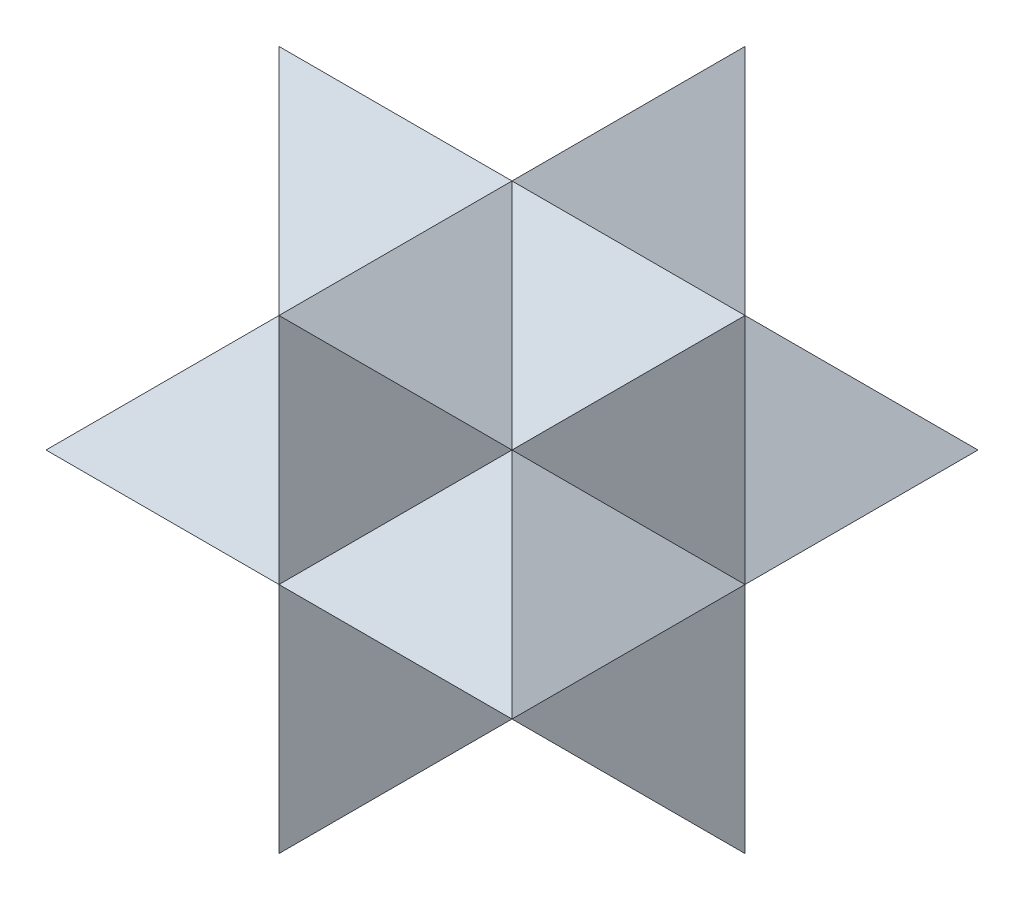
ISO-10303-21;
HEADER;
FILE_DESCRIPTION(('STEP AP214'),'2;1');
FILE_NAME('part.step','',(''),(''),'','','');
FILE_SCHEMA(('AUTOMOTIVE_DESIGN { 1 0 10303 214 1 1 1 1 }'));
ENDSEC;
DATA;
#1=APPLICATION_CONTEXT('core data for automotive mechanical design processes');
#2=APPLICATION_PROTOCOL_DEFINITION('international standard','automotive_design',2000,#1);
#3=PRODUCT_CONTEXT('',#1,'mechanical');
#4=PRODUCT('Part','Part','',(#3));
#5=PRODUCT_RELATED_PRODUCT_CATEGORY('part','',(#4));
#6=PRODUCT_DEFINITION_FORMATION('','',#4);
#7=PRODUCT_DEFINITION_CONTEXT('part definition',#1,'design');
#8=PRODUCT_DEFINITION('design','',#6,#7);
#9=PRODUCT_DEFINITION_SHAPE('','',#8);
#10=(LENGTH_UNIT() NAMED_UNIT(*) SI_UNIT(.MILLI.,.METRE.));
#11=(NAMED_UNIT(*) PLANE_ANGLE_UNIT() SI_UNIT($,.RADIAN.));
#12=(NAMED_UNIT(*) SI_UNIT($,.STERADIAN.) SOLID_ANGLE_UNIT());
#13=UNCERTAINTY_MEASURE_WITH_UNIT(LENGTH_MEASURE(1.E-05),#10,'distance_accuracy_value','');
#14=(GEOMETRIC_REPRESENTATION_CONTEXT(3) GLOBAL_UNCERTAINTY_ASSIGNED_CONTEXT((#13)) GLOBAL_UNIT_ASSIGNED_CONTEXT((#10,
#11,#12)) REPRESENTATION_CONTEXT('',''));
#15=CARTESIAN_POINT('',(0.,0.,0.));
#16=DIRECTION('',(0.,0.,1.));
#17=DIRECTION('',(1.,0.,0.));
#18=AXIS2_PLACEMENT_3D('',#15,#16,#17);
#19=CARTESIAN_POINT('',(0.,-160.009973336649,-160.009973336649));
#20=DIRECTION('',(0.707106781186547,0.,-0.707106781186547));
#21=DIRECTION('',(0.,1.,0.));
#22=AXIS2_PLACEMENT_3D('',#19,#20,#21);
#23=PLANE('',#22);
#24=DIRECTION('',(0.577350269189626,-0.577350269189626,0.577350269189626));
#25=VECTOR('',#24,1.);
#26=CARTESIAN_POINT('',(106.673315557766,53.336657778883,-53.336657778883));
#27=LINE('',#26,#25);
#28=CARTESIAN_POINT('',(80.0049866683244,80.0049866683245,-80.0049866683244));
#29=VERTEX_POINT('',#28);
#30=CARTESIAN_POINT('',(160.009973336649,0.,0.));
#31=VERTEX_POINT('',#30);
#32=EDGE_CURVE('E566',#29,#31,#27,.T.);
#33=ORIENTED_EDGE('',*,*,#32,.F.);
#34=DIRECTION('',(-0.577350269189626,-0.577350269189626,-0.577350269189626));
#35=VECTOR('',#34,1.);
#36=CARTESIAN_POINT('',(80.0049866683244,80.0049866683245,-80.0049866683244));
#37=LINE('',#36,#35);
#38=CARTESIAN_POINT('',(160.009973336649,160.009973336649,0.));
#39=VERTEX_POINT('',#38);
#40=EDGE_CURVE('E594',#39,#29,#37,.T.);
#41=ORIENTED_EDGE('',*,*,#40,.F.);
#42=DIRECTION('',(0.,-1.,0.));
#43=VECTOR('',#42,1.);
#44=CARTESIAN_POINT('',(160.009973336649,0.,0.));
#45=LINE('',#44,#43);
#46=EDGE_CURVE('E597',#39,#31,#45,.T.);
#47=ORIENTED_EDGE('',*,*,#46,.T.);
#48=EDGE_LOOP('',(#33,#41,#47));
#49=FACE_BOUND('',#48,.T.);
#50=ADVANCED_FACE('F360',(#49),#23,.T.);
#51=CARTESIAN_POINT('',(0.,160.009973336649,-160.009973336649));
#52=DIRECTION('',(-0.707106781186548,0.,-0.707106781186547));
#53=DIRECTION('',(0.,-1.,0.));
#54=AXIS2_PLACEMENT_3D('',#51,#52,#53);
#55=PLANE('',#54);
#56=DIRECTION('',(0.577350269189626,-0.577350269189626,-0.577350269189626));
#57=VECTOR('',#56,1.);
#58=CARTESIAN_POINT('',(-53.336657778883,53.336657778883,-106.673315557766));
#59=LINE('',#58,#57);
#60=CARTESIAN_POINT('',(-80.0049866683244,80.0049866683245,-80.0049866683244));
#61=VERTEX_POINT('',#60);
#62=CARTESIAN_POINT('',(0.,0.,-160.009973336649));
#63=VERTEX_POINT('',#62);
#64=EDGE_CURVE('E557',#61,#63,#59,.T.);
#65=ORIENTED_EDGE('',*,*,#64,.F.);
#66=DIRECTION('',(-0.577350269189626,-0.577350269189626,0.577350269189626));
#67=VECTOR('',#66,1.);
#68=CARTESIAN_POINT('',(-80.0049866683244,80.0049866683245,-80.0049866683244));
#69=LINE('',#68,#67);
#70=CARTESIAN_POINT('',(0.,160.009973336649,-160.009973336649));
#71=VERTEX_POINT('',#70);
#72=EDGE_CURVE('E610',#71,#61,#69,.T.);
#73=ORIENTED_EDGE('',*,*,#72,.F.);
#74=DIRECTION('',(0.,1.,0.));
#75=VECTOR('',#74,1.);
#76=CARTESIAN_POINT('',(0.,0.,-160.009973336649));
#77=LINE('',#76,#75);
#78=EDGE_CURVE('E640',#63,#71,#77,.T.);
#79=ORIENTED_EDGE('',*,*,#78,.F.);
#80=EDGE_LOOP('',(#65,#73,#79));
#81=FACE_BOUND('',#80,.T.);
#82=ADVANCED_FACE('F701',(#81),#55,.T.);
#83=CARTESIAN_POINT('',(0.,-160.009973336649,160.009973336649));
#84=DIRECTION('',(-0.707106781186547,0.,0.707106781186548));
#85=DIRECTION('',(0.,1.,0.));
#86=AXIS2_PLACEMENT_3D('',#83,#84,#85);
#87=PLANE('',#86);
#88=DIRECTION('',(-0.577350269189626,0.577350269189626,-0.577350269189626));
#89=VECTOR('',#88,1.);
#90=CARTESIAN_POINT('',(53.336657778883,-53.336657778883,213.346631115532));
#91=LINE('',#90,#89);
#92=CARTESIAN_POINT('',(0.,0.,160.009973336649));
#93=VERTEX_POINT('',#92);
#94=CARTESIAN_POINT('',(-80.0049866683244,80.0049866683244,80.0049866683244));
#95=VERTEX_POINT('',#94);
#96=EDGE_CURVE('E571',#93,#95,#91,.T.);
#97=ORIENTED_EDGE('',*,*,#96,.F.);
#98=DIRECTION('',(0.,-1.,0.));
#99=VECTOR('',#98,1.);
#100=CARTESIAN_POINT('',(0.,0.,160.009973336649));
#101=LINE('',#100,#99);
#102=CARTESIAN_POINT('',(0.,160.009973336649,160.009973336649));
#103=VERTEX_POINT('',#102);
#104=EDGE_CURVE('E631',#103,#93,#101,.T.);
#105=ORIENTED_EDGE('',*,*,#104,.F.);
#106=DIRECTION('',(-0.577350269189626,-0.577350269189626,-0.577350269189626));
#107=VECTOR('',#106,1.);
#108=CARTESIAN_POINT('',(-80.0049866683244,80.0049866683244,80.0049866683244));
#109=LINE('',#108,#107);
#110=EDGE_CURVE('E618',#103,#95,#109,.T.);
#111=ORIENTED_EDGE('',*,*,#110,.T.);
#112=EDGE_LOOP('',(#97,#105,#111));
#113=FACE_BOUND('',#112,.T.);
#114=ADVANCED_FACE('F694',(#113),#87,.T.);
#115=CARTESIAN_POINT('',(0.,160.009973336649,160.009973336649));
#116=DIRECTION('',(0.707106781186547,0.,0.707106781186547));
#117=DIRECTION('',(0.,-1.,0.));
#118=AXIS2_PLACEMENT_3D('',#115,#116,#117);
#119=PLANE('',#118);
#120=DIRECTION('',(-0.577350269189626,-0.577350269189626,0.577350269189626));
#121=VECTOR('',#120,1.);
#122=CARTESIAN_POINT('',(53.336657778883,53.336657778883,106.673315557766));
#123=LINE('',#122,#121);
#124=CARTESIAN_POINT('',(80.0049866683245,80.0049866683244,80.0049866683245));
#125=VERTEX_POINT('',#124);
#126=EDGE_CURVE('E569',#125,#93,#123,.T.);
#127=ORIENTED_EDGE('',*,*,#126,.F.);
#128=DIRECTION('',(0.577350269189626,-0.577350269189626,-0.577350269189626));
#129=VECTOR('',#128,1.);
#130=CARTESIAN_POINT('',(80.0049866683244,80.0049866683244,80.0049866683245));
#131=LINE('',#130,#129);
#132=EDGE_CURVE('E628',#103,#125,#131,.T.);
#133=ORIENTED_EDGE('',*,*,#132,.F.);
#134=ORIENTED_EDGE('',*,*,#104,.T.);
#135=EDGE_LOOP('',(#127,#133,#134));
#136=FACE_BOUND('',#135,.T.);
#137=ADVANCED_FACE('F732',(#136),#119,.T.);
#138=CARTESIAN_POINT('',(0.,160.009973336649,-160.009973336649));
#139=DIRECTION('',(0.707106781186547,0.707106781186547,0.));
#140=DIRECTION('',(0.,0.,1.));
#141=AXIS2_PLACEMENT_3D('',#138,#139,#140);
#142=PLANE('',#141);
#143=DIRECTION('',(-0.577350269189626,0.577350269189626,0.577350269189626));
#144=VECTOR('',#143,1.);
#145=CARTESIAN_POINT('',(53.336657778883,106.673315557766,-53.336657778883));
#146=LINE('',#145,#144);
#147=CARTESIAN_POINT('',(0.,160.009973336649,0.));
#148=VERTEX_POINT('',#147);
#149=EDGE_CURVE('E586',#29,#148,#146,.T.);
#150=ORIENTED_EDGE('',*,*,#149,.F.);
#151=DIRECTION('',(0.577350269189626,-0.577350269189626,0.577350269189626));
#152=VECTOR('',#151,1.);
#153=CARTESIAN_POINT('',(80.0049866683244,80.0049866683245,-80.0049866683244));
#154=LINE('',#153,#152);
#155=EDGE_CURVE('E614',#71,#29,#154,.T.);
#156=ORIENTED_EDGE('',*,*,#155,.F.);
#157=DIRECTION('',(0.,0.,1.));
#158=VECTOR('',#157,1.);
#159=CARTESIAN_POINT('',(0.,160.009973336649,0.));
#160=LINE('',#159,#158);
#161=EDGE_CURVE('E623',#71,#148,#160,.T.);
#162=ORIENTED_EDGE('',*,*,#161,.T.);
#163=EDGE_LOOP('',(#150,#156,#162));
#164=FACE_BOUND('',#163,.T.);
#165=ADVANCED_FACE('F724',(#164),#142,.T.);
#166=DIRECTION('',(0.577350269189626,0.577350269189626,0.577350269189626));
#167=VECTOR('',#166,1.);
#168=CARTESIAN_POINT('',(-53.3366577788829,-53.336657778883,-213.346631115532));
#169=LINE('',#168,#167);
#170=EDGE_CURVE('E560',#63,#29,#169,.T.);
#171=ORIENTED_EDGE('',*,*,#170,.F.);
#172=ORIENTED_EDGE('',*,*,#78,.T.);
#173=ORIENTED_EDGE('',*,*,#155,.T.);
#174=EDGE_LOOP('',(#171,#172,#173));
#175=FACE_BOUND('',#174,.T.);
#176=ADVANCED_FACE('F362',(#175),#23,.T.);
#177=DIRECTION('',(0.577350269189626,0.577350269189626,-0.577350269189626));
#178=VECTOR('',#177,1.);
#179=CARTESIAN_POINT('',(0.,160.009973336649,-160.009973336649));
#180=LINE('',#179,#178);
#181=CARTESIAN_POINT('',(-160.009973336649,0.,0.));
#182=VERTEX_POINT('',#181);
#183=EDGE_CURVE('E554',#182,#61,#180,.T.);
#184=ORIENTED_EDGE('',*,*,#183,.F.);
#185=DIRECTION('',(0.,1.,0.));
#186=VECTOR('',#185,1.);
#187=CARTESIAN_POINT('',(-160.009973336649,0.,0.));
#188=LINE('',#187,#186);
#189=CARTESIAN_POINT('',(-160.009973336649,160.009973336649,0.));
#190=VERTEX_POINT('',#189);
#191=EDGE_CURVE('E587',#182,#190,#188,.T.);
#192=ORIENTED_EDGE('',*,*,#191,.T.);
#193=DIRECTION('',(0.577350269189626,-0.577350269189626,-0.577350269189626));
#194=VECTOR('',#193,1.);
#195=CARTESIAN_POINT('',(-80.0049866683244,80.0049866683245,-80.0049866683244));
#196=LINE('',#195,#194);
#197=EDGE_CURVE('E588',#190,#61,#196,.T.);
#198=ORIENTED_EDGE('',*,*,#197,.T.);
#199=EDGE_LOOP('',(#184,#192,#198));
#200=FACE_BOUND('',#199,.T.);
#201=ADVANCED_FACE('F721',(#200),#55,.T.);
#202=CARTESIAN_POINT('',(0.,160.009973336649,160.009973336649));
#203=DIRECTION('',(-0.707106781186548,0.707106781186547,0.));
#204=DIRECTION('',(0.,0.,-1.));
#205=AXIS2_PLACEMENT_3D('',#202,#203,#204);
#206=PLANE('',#205);
#207=DIRECTION('',(-0.577350269189626,-0.577350269189626,-0.577350269189626));
#208=VECTOR('',#207,1.);
#209=CARTESIAN_POINT('',(53.336657778883,213.346631115532,53.336657778883));
#210=LINE('',#209,#208);
#211=EDGE_CURVE('E626',#148,#61,#210,.T.);
#212=ORIENTED_EDGE('',*,*,#211,.F.);
#213=ORIENTED_EDGE('',*,*,#161,.F.);
#214=ORIENTED_EDGE('',*,*,#72,.T.);
#215=EDGE_LOOP('',(#212,#213,#214));
#216=FACE_BOUND('',#215,.T.);
#217=ADVANCED_FACE('F730',(#216),#206,.T.);
#218=CARTESIAN_POINT('',(-160.009973336649,160.009973336649,0.));
#219=DIRECTION('',(0.,0.707106781186548,-0.707106781186547));
#220=DIRECTION('',(1.,0.,0.));
#221=AXIS2_PLACEMENT_3D('',#218,#219,#220);
#222=PLANE('',#221);
#223=DIRECTION('',(1.,0.,0.));
#224=VECTOR('',#223,1.);
#225=CARTESIAN_POINT('',(0.,160.009973336649,0.));
#226=LINE('',#225,#224);
#227=EDGE_CURVE('E590',#190,#148,#226,.T.);
#228=ORIENTED_EDGE('',*,*,#227,.T.);
#229=ORIENTED_EDGE('',*,*,#211,.T.);
#230=ORIENTED_EDGE('',*,*,#197,.F.);
#231=EDGE_LOOP('',(#228,#229,#230));
#232=FACE_BOUND('',#231,.T.);
#233=ADVANCED_FACE('F762',(#232),#222,.T.);
#234=ORIENTED_EDGE('',*,*,#40,.T.);
#235=ORIENTED_EDGE('',*,*,#149,.T.);
#236=EDGE_CURVE('E593',#148,#39,#226,.T.);
#237=ORIENTED_EDGE('',*,*,#236,.T.);
#238=EDGE_LOOP('',(#234,#235,#237));
#239=FACE_BOUND('',#238,.T.);
#240=ADVANCED_FACE('F768',(#239),#222,.T.);
#241=CARTESIAN_POINT('',(160.009973336649,160.009973336649,0.));
#242=DIRECTION('',(0.,0.707106781186547,0.707106781186547));
#243=DIRECTION('',(-1.,0.,0.));
#244=AXIS2_PLACEMENT_3D('',#241,#242,#243);
#245=PLANE('',#244);
#246=ORIENTED_EDGE('',*,*,#236,.F.);
#247=DIRECTION('',(0.577350269189626,-0.577350269189626,0.577350269189626));
#248=VECTOR('',#247,1.);
#249=CARTESIAN_POINT('',(-53.336657778883,213.346631115532,-53.336657778883));
#250=LINE('',#249,#248);
#251=EDGE_CURVE('E647',#148,#125,#250,.T.);
#252=ORIENTED_EDGE('',*,*,#251,.T.);
#253=DIRECTION('',(-0.577350269189626,-0.577350269189626,0.577350269189626));
#254=VECTOR('',#253,1.);
#255=CARTESIAN_POINT('',(80.0049866683244,80.0049866683244,80.0049866683244));
#256=LINE('',#255,#254);
#257=EDGE_CURVE('E490',#39,#125,#256,.T.);
#258=ORIENTED_EDGE('',*,*,#257,.F.);
#259=EDGE_LOOP('',(#246,#252,#258));
#260=FACE_BOUND('',#259,.T.);
#261=ADVANCED_FACE('F812',(#260),#245,.T.);
#262=DIRECTION('',(-0.577350269189626,-0.577350269189626,-0.577350269189626));
#263=VECTOR('',#262,1.);
#264=CARTESIAN_POINT('',(-106.673315557766,53.3366577788829,53.336657778883));
#265=LINE('',#264,#263);
#266=EDGE_CURVE('E530',#95,#182,#265,.T.);
#267=ORIENTED_EDGE('',*,*,#266,.F.);
#268=DIRECTION('',(0.577350269189626,-0.577350269189626,0.577350269189626));
#269=VECTOR('',#268,1.);
#270=CARTESIAN_POINT('',(-80.0049866683244,80.0049866683244,80.0049866683244));
#271=LINE('',#270,#269);
#272=EDGE_CURVE('E576',#190,#95,#271,.T.);
#273=ORIENTED_EDGE('',*,*,#272,.F.);
#274=ORIENTED_EDGE('',*,*,#191,.F.);
#275=EDGE_LOOP('',(#267,#273,#274));
#276=FACE_BOUND('',#275,.T.);
#277=ADVANCED_FACE('F693',(#276),#87,.T.);
#278=DIRECTION('',(-0.577350269189626,0.577350269189626,0.577350269189626));
#279=VECTOR('',#278,1.);
#280=CARTESIAN_POINT('',(0.,160.009973336649,160.009973336649));
#281=LINE('',#280,#279);
#282=EDGE_CURVE('E563',#31,#125,#281,.T.);
#283=ORIENTED_EDGE('',*,*,#282,.F.);
#284=ORIENTED_EDGE('',*,*,#46,.F.);
#285=ORIENTED_EDGE('',*,*,#257,.T.);
#286=EDGE_LOOP('',(#283,#284,#285));
#287=FACE_BOUND('',#286,.T.);
#288=ADVANCED_FACE('F811',(#287),#119,.T.);
#289=ORIENTED_EDGE('',*,*,#251,.F.);
#290=EDGE_CURVE('E627',#148,#103,#160,.T.);
#291=ORIENTED_EDGE('',*,*,#290,.T.);
#292=ORIENTED_EDGE('',*,*,#132,.T.);
#293=EDGE_LOOP('',(#289,#291,#292));
#294=FACE_BOUND('',#293,.T.);
#295=ADVANCED_FACE('F735',(#294),#142,.T.);
#296=DIRECTION('',(0.577350269189626,0.577350269189626,-0.577350269189626));
#297=VECTOR('',#296,1.);
#298=CARTESIAN_POINT('',(-53.336657778883,106.673315557766,53.336657778883));
#299=LINE('',#298,#297);
#300=EDGE_CURVE('E479',#95,#148,#299,.T.);
#301=ORIENTED_EDGE('',*,*,#300,.F.);
#302=ORIENTED_EDGE('',*,*,#110,.F.);
#303=ORIENTED_EDGE('',*,*,#290,.F.);
#304=EDGE_LOOP('',(#301,#302,#303));
#305=FACE_BOUND('',#304,.T.);
#306=ADVANCED_FACE('F829',(#305),#206,.T.);
#307=ORIENTED_EDGE('',*,*,#272,.T.);
#308=ORIENTED_EDGE('',*,*,#300,.T.);
#309=ORIENTED_EDGE('',*,*,#227,.F.);
#310=EDGE_LOOP('',(#307,#308,#309));
#311=FACE_BOUND('',#310,.T.);
#312=ADVANCED_FACE('F822',(#311),#245,.T.);
#313=CARTESIAN_POINT('',(160.009973336649,0.,160.009973336649));
#314=DIRECTION('',(0.707106781186548,0.707106781186547,0.));
#315=DIRECTION('',(0.,0.,-1.));
#316=AXIS2_PLACEMENT_3D('',#313,#314,#315);
#317=PLANE('',#316);
#318=DIRECTION('',(0.,0.,-1.));
#319=VECTOR('',#318,1.);
#320=CARTESIAN_POINT('',(160.009973336649,0.,0.));
#321=LINE('',#320,#319);
#322=CARTESIAN_POINT('',(160.009973336649,0.,160.009973336649));
#323=VERTEX_POINT('',#322);
#324=EDGE_CURVE('E513',#323,#31,#321,.T.);
#325=ORIENTED_EDGE('',*,*,#324,.T.);
#326=ORIENTED_EDGE('',*,*,#282,.T.);
#327=DIRECTION('',(-0.577350269189626,0.577350269189626,-0.577350269189626));
#328=VECTOR('',#327,1.);
#329=CARTESIAN_POINT('',(80.0049866683244,80.0049866683245,80.0049866683245));
#330=LINE('',#329,#328);
#331=EDGE_CURVE('E531',#323,#125,#330,.T.);
#332=ORIENTED_EDGE('',*,*,#331,.F.);
#333=EDGE_LOOP('',(#325,#326,#332));
#334=FACE_BOUND('',#333,.T.);
#335=ADVANCED_FACE('F839',(#334),#317,.T.);
#336=CARTESIAN_POINT('',(-160.009973336649,0.,160.009973336649));
#337=DIRECTION('',(0.,0.707106781186547,0.707106781186548));
#338=DIRECTION('',(1.,0.,0.));
#339=AXIS2_PLACEMENT_3D('',#336,#337,#338);
#340=PLANE('',#339);
#341=ORIENTED_EDGE('',*,*,#331,.T.);
#342=ORIENTED_EDGE('',*,*,#126,.T.);
#343=DIRECTION('',(1.,0.,0.));
#344=VECTOR('',#343,1.);
#345=CARTESIAN_POINT('',(0.,0.,160.009973336649));
#346=LINE('',#345,#344);
#347=EDGE_CURVE('E508',#93,#323,#346,.T.);
#348=ORIENTED_EDGE('',*,*,#347,.T.);
#349=EDGE_LOOP('',(#341,#342,#348));
#350=FACE_BOUND('',#349,.T.);
#351=ADVANCED_FACE('F841',(#350),#340,.T.);
#352=CARTESIAN_POINT('',(-160.009973336649,0.,-160.009973336649));
#353=DIRECTION('',(-0.707106781186548,0.707106781186547,0.));
#354=DIRECTION('',(0.,0.,1.));
#355=AXIS2_PLACEMENT_3D('',#352,#353,#354);
#356=PLANE('',#355);
#357=DIRECTION('',(0.577350269189626,0.577350269189626,-0.577350269189626));
#358=VECTOR('',#357,1.);
#359=CARTESIAN_POINT('',(-80.0049866683244,80.0049866683245,80.0049866683245));
#360=LINE('',#359,#358);
#361=CARTESIAN_POINT('',(-160.009973336649,0.,160.009973336649));
#362=VERTEX_POINT('',#361);
#363=EDGE_CURVE('E509',#362,#95,#360,.T.);
#364=ORIENTED_EDGE('',*,*,#363,.T.);
#365=ORIENTED_EDGE('',*,*,#266,.T.);
#366=DIRECTION('',(0.,0.,1.));
#367=VECTOR('',#366,1.);
#368=CARTESIAN_POINT('',(-160.009973336649,0.,0.));
#369=LINE('',#368,#367);
#370=EDGE_CURVE('E549',#182,#362,#369,.T.);
#371=ORIENTED_EDGE('',*,*,#370,.T.);
#372=EDGE_LOOP('',(#364,#365,#371));
#373=FACE_BOUND('',#372,.T.);
#374=ADVANCED_FACE('F667',(#373),#356,.T.);
#375=EDGE_CURVE('E527',#362,#93,#346,.T.);
#376=ORIENTED_EDGE('',*,*,#375,.T.);
#377=ORIENTED_EDGE('',*,*,#96,.T.);
#378=ORIENTED_EDGE('',*,*,#363,.F.);
#379=EDGE_LOOP('',(#376,#377,#378));
#380=FACE_BOUND('',#379,.T.);
#381=ADVANCED_FACE('F671',(#380),#340,.T.);
#382=CARTESIAN_POINT('',(-160.009973336649,0.,-160.009973336649));
#383=VERTEX_POINT('',#382);
#384=EDGE_CURVE('E546',#383,#182,#369,.T.);
#385=ORIENTED_EDGE('',*,*,#384,.T.);
#386=ORIENTED_EDGE('',*,*,#183,.T.);
#387=DIRECTION('',(0.577350269189626,0.577350269189626,0.577350269189626));
#388=VECTOR('',#387,1.);
#389=CARTESIAN_POINT('',(-80.0049866683244,80.0049866683245,-80.0049866683244));
#390=LINE('',#389,#388);
#391=EDGE_CURVE('E543',#383,#61,#390,.T.);
#392=ORIENTED_EDGE('',*,*,#391,.F.);
#393=EDGE_LOOP('',(#385,#386,#392));
#394=FACE_BOUND('',#393,.T.);
#395=ADVANCED_FACE('F756',(#394),#356,.T.);
#396=CARTESIAN_POINT('',(160.009973336649,0.,-160.009973336649));
#397=DIRECTION('',(0.,0.707106781186547,-0.707106781186547));
#398=DIRECTION('',(-1.,0.,0.));
#399=AXIS2_PLACEMENT_3D('',#396,#397,#398);
#400=PLANE('',#399);
#401=ORIENTED_EDGE('',*,*,#391,.T.);
#402=ORIENTED_EDGE('',*,*,#64,.T.);
#403=DIRECTION('',(-1.,0.,0.));
#404=VECTOR('',#403,1.);
#405=CARTESIAN_POINT('',(0.,0.,-160.009973336649));
#406=LINE('',#405,#404);
#407=EDGE_CURVE('E542',#63,#383,#406,.T.);
#408=ORIENTED_EDGE('',*,*,#407,.T.);
#409=EDGE_LOOP('',(#401,#402,#408));
#410=FACE_BOUND('',#409,.T.);
#411=ADVANCED_FACE('F753',(#410),#400,.T.);
#412=DIRECTION('',(-0.577350269189626,0.577350269189626,0.577350269189626));
#413=VECTOR('',#412,1.);
#414=CARTESIAN_POINT('',(80.0049866683244,80.0049866683245,-80.0049866683244));
#415=LINE('',#414,#413);
#416=CARTESIAN_POINT('',(160.009973336649,0.,-160.009973336649));
#417=VERTEX_POINT('',#416);
#418=EDGE_CURVE('E536',#417,#29,#415,.T.);
#419=ORIENTED_EDGE('',*,*,#418,.T.);
#420=ORIENTED_EDGE('',*,*,#32,.T.);
#421=EDGE_CURVE('E535',#31,#417,#321,.T.);
#422=ORIENTED_EDGE('',*,*,#421,.T.);
#423=EDGE_LOOP('',(#419,#420,#422));
#424=FACE_BOUND('',#423,.T.);
#425=ADVANCED_FACE('F773',(#424),#317,.T.);
#426=EDGE_CURVE('E539',#417,#63,#406,.T.);
#427=ORIENTED_EDGE('',*,*,#426,.T.);
#428=ORIENTED_EDGE('',*,*,#170,.T.);
#429=ORIENTED_EDGE('',*,*,#418,.F.);
#430=EDGE_LOOP('',(#427,#428,#429));
#431=FACE_BOUND('',#430,.T.);
#432=ADVANCED_FACE('F744',(#431),#400,.T.);
#433=CARTESIAN_POINT('',(160.009973336649,0.,-160.009973336649));
#434=DIRECTION('',(0.707106781186547,-0.707106781186548,0.));
#435=DIRECTION('',(0.,0.,1.));
#436=AXIS2_PLACEMENT_3D('',#433,#434,#435);
#437=PLANE('',#436);
#438=ORIENTED_EDGE('',*,*,#421,.F.);
#439=DIRECTION('',(-0.577350269189626,-0.577350269189625,-0.577350269189626));
#440=VECTOR('',#439,1.);
#441=CARTESIAN_POINT('',(0.,-160.009973336649,-160.009973336649));
#442=LINE('',#441,#440);
#443=CARTESIAN_POINT('',(80.0049866683244,-80.0049866683244,-80.0049866683245));
#444=VERTEX_POINT('',#443);
#445=EDGE_CURVE('E650',#31,#444,#442,.T.);
#446=ORIENTED_EDGE('',*,*,#445,.T.);
#447=DIRECTION('',(-0.577350269189626,-0.577350269189626,0.577350269189626));
#448=VECTOR('',#447,1.);
#449=CARTESIAN_POINT('',(80.0049866683244,-80.0049866683244,-80.0049866683245));
#450=LINE('',#449,#448);
#451=EDGE_CURVE('E514',#417,#444,#450,.T.);
#452=ORIENTED_EDGE('',*,*,#451,.F.);
#453=EDGE_LOOP('',(#438,#446,#452));
#454=FACE_BOUND('',#453,.T.);
#455=ADVANCED_FACE('F775',(#454),#437,.T.);
#456=CARTESIAN_POINT('',(-160.009973336649,0.,-160.009973336649));
#457=DIRECTION('',(0.,-0.707106781186547,-0.707106781186547));
#458=DIRECTION('',(1.,0.,0.));
#459=AXIS2_PLACEMENT_3D('',#456,#457,#458);
#460=PLANE('',#459);
#461=ORIENTED_EDGE('',*,*,#451,.T.);
#462=DIRECTION('',(-0.577350269189626,0.577350269189626,-0.577350269189626));
#463=VECTOR('',#462,1.);
#464=CARTESIAN_POINT('',(53.336657778883,-53.3366577788829,-106.673315557766));
#465=LINE('',#464,#463);
#466=EDGE_CURVE('E653',#444,#63,#465,.T.);
#467=ORIENTED_EDGE('',*,*,#466,.T.);
#468=ORIENTED_EDGE('',*,*,#426,.F.);
#469=EDGE_LOOP('',(#461,#467,#468));
#470=FACE_BOUND('',#469,.T.);
#471=ADVANCED_FACE('F748',(#470),#460,.T.);
#472=CARTESIAN_POINT('',(-160.009973336649,-160.009973336649,0.));
#473=DIRECTION('',(0.,-0.707106781186547,0.707106781186547));
#474=DIRECTION('',(1.,0.,0.));
#475=AXIS2_PLACEMENT_3D('',#472,#473,#474);
#476=PLANE('',#475);
#477=DIRECTION('',(-0.577350269189626,0.577350269189626,0.577350269189626));
#478=VECTOR('',#477,1.);
#479=CARTESIAN_POINT('',(80.0049866683244,-80.0049866683244,80.0049866683244));
#480=LINE('',#479,#478);
#481=CARTESIAN_POINT('',(160.009973336649,-160.009973336649,0.));
#482=VERTEX_POINT('',#481);
#483=CARTESIAN_POINT('',(80.0049866683244,-80.0049866683244,80.0049866683244));
#484=VERTEX_POINT('',#483);
#485=EDGE_CURVE('E482',#482,#484,#480,.T.);
#486=ORIENTED_EDGE('',*,*,#485,.T.);
#487=DIRECTION('',(-0.577350269189626,-0.577350269189626,-0.577350269189626));
#488=VECTOR('',#487,1.);
#489=CARTESIAN_POINT('',(53.3366577788829,-106.673315557766,53.336657778883));
#490=LINE('',#489,#488);
#491=CARTESIAN_POINT('',(0.,-160.009973336649,0.));
#492=VERTEX_POINT('',#491);
#493=EDGE_CURVE('E471',#484,#492,#490,.T.);
#494=ORIENTED_EDGE('',*,*,#493,.T.);
#495=DIRECTION('',(-1.,0.,0.));
#496=VECTOR('',#495,1.);
#497=CARTESIAN_POINT('',(0.,-160.009973336649,0.));
#498=LINE('',#497,#496);
#499=EDGE_CURVE('E486',#482,#492,#498,.T.);
#500=ORIENTED_EDGE('',*,*,#499,.F.);
#501=EDGE_LOOP('',(#486,#494,#500));
#502=FACE_BOUND('',#501,.T.);
#503=ADVANCED_FACE('F484',(#502),#476,.T.);
#504=CARTESIAN_POINT('',(0.,-160.009973336649,160.009973336649));
#505=DIRECTION('',(0.707106781186547,-0.707106781186547,0.));
#506=DIRECTION('',(0.,0.,-1.));
#507=AXIS2_PLACEMENT_3D('',#504,#505,#506);
#508=PLANE('',#507);
#509=ORIENTED_EDGE('',*,*,#493,.F.);
#510=DIRECTION('',(0.577350269189626,0.577350269189626,-0.577350269189626));
#511=VECTOR('',#510,1.);
#512=CARTESIAN_POINT('',(80.0049866683244,-80.0049866683244,80.0049866683244));
#513=LINE('',#512,#511);
#514=CARTESIAN_POINT('',(0.,-160.009973336649,160.009973336649));
#515=VERTEX_POINT('',#514);
#516=EDGE_CURVE('E459',#515,#484,#513,.T.);
#517=ORIENTED_EDGE('',*,*,#516,.F.);
#518=DIRECTION('',(0.,0.,-1.));
#519=VECTOR('',#518,1.);
#520=CARTESIAN_POINT('',(0.,-160.009973336649,0.));
#521=LINE('',#520,#519);
#522=EDGE_CURVE('E468',#515,#492,#521,.T.);
#523=ORIENTED_EDGE('',*,*,#522,.T.);
#524=EDGE_LOOP('',(#509,#517,#523));
#525=FACE_BOUND('',#524,.T.);
#526=ADVANCED_FACE('F473',(#525),#508,.T.);
#527=CARTESIAN_POINT('',(0.,-160.009973336649,-160.009973336649));
#528=DIRECTION('',(-0.707106781186547,-0.707106781186548,0.));
#529=DIRECTION('',(0.,0.,1.));
#530=AXIS2_PLACEMENT_3D('',#527,#528,#529);
#531=PLANE('',#530);
#532=DIRECTION('',(-0.577350269189626,0.577350269189626,0.577350269189626));
#533=VECTOR('',#532,1.);
#534=CARTESIAN_POINT('',(53.336657778883,-213.346631115532,-53.336657778883));
#535=LINE('',#534,#533);
#536=CARTESIAN_POINT('',(-80.0049866683244,-80.0049866683244,80.0049866683244));
#537=VERTEX_POINT('',#536);
#538=EDGE_CURVE('E478',#492,#537,#535,.T.);
#539=ORIENTED_EDGE('',*,*,#538,.F.);
#540=ORIENTED_EDGE('',*,*,#522,.F.);
#541=DIRECTION('',(-0.577350269189626,0.577350269189626,-0.577350269189626));
#542=VECTOR('',#541,1.);
#543=CARTESIAN_POINT('',(-80.0049866683244,-80.0049866683244,80.0049866683244));
#544=LINE('',#543,#542);
#545=EDGE_CURVE('E615',#515,#537,#544,.T.);
#546=ORIENTED_EDGE('',*,*,#545,.T.);
#547=EDGE_LOOP('',(#539,#540,#546));
#548=FACE_BOUND('',#547,.T.);
#549=ADVANCED_FACE('F684',(#548),#531,.T.);
#550=DIRECTION('',(0.577350269189626,0.577350269189626,0.577350269189626));
#551=VECTOR('',#550,1.);
#552=CARTESIAN_POINT('',(-53.336657778883,-53.3366577788829,106.673315557766));
#553=LINE('',#552,#551);
#554=EDGE_CURVE('E12',#537,#93,#553,.T.);
#555=ORIENTED_EDGE('',*,*,#554,.F.);
#556=ORIENTED_EDGE('',*,*,#545,.F.);
#557=EDGE_CURVE('E465',#93,#515,#101,.T.);
#558=ORIENTED_EDGE('',*,*,#557,.F.);
#559=EDGE_LOOP('',(#555,#556,#558));
#560=FACE_BOUND('',#559,.T.);
#561=ADVANCED_FACE('F677',(#560),#87,.T.);
#562=DIRECTION('',(0.577350269189626,-0.577350269189626,-0.577350269189626));
#563=VECTOR('',#562,1.);
#564=CARTESIAN_POINT('',(-53.336657778883,53.3366577788829,213.346631115532));
#565=LINE('',#564,#563);
#566=EDGE_CURVE('E463',#93,#484,#565,.T.);
#567=ORIENTED_EDGE('',*,*,#566,.F.);
#568=ORIENTED_EDGE('',*,*,#557,.T.);
#569=ORIENTED_EDGE('',*,*,#516,.T.);
#570=EDGE_LOOP('',(#567,#568,#569));
#571=FACE_BOUND('',#570,.T.);
#572=ADVANCED_FACE('F461',(#571),#119,.T.);
#573=CARTESIAN_POINT('',(-160.009973336649,-160.009973336649,0.));
#574=VERTEX_POINT('',#573);
#575=EDGE_CURVE('E603',#492,#574,#498,.T.);
#576=ORIENTED_EDGE('',*,*,#575,.F.);
#577=ORIENTED_EDGE('',*,*,#538,.T.);
#578=DIRECTION('',(0.577350269189626,0.577350269189626,0.577350269189626));
#579=VECTOR('',#578,1.);
#580=CARTESIAN_POINT('',(-80.0049866683244,-80.0049866683244,80.0049866683244));
#581=LINE('',#580,#579);
#582=EDGE_CURVE('E573',#574,#537,#581,.T.);
#583=ORIENTED_EDGE('',*,*,#582,.F.);
#584=EDGE_LOOP('',(#576,#577,#583));
#585=FACE_BOUND('',#584,.T.);
#586=ADVANCED_FACE('F679',(#585),#476,.T.);
#587=DIRECTION('',(0.577350269189626,-0.577350269189626,0.577350269189626));
#588=VECTOR('',#587,1.);
#589=CARTESIAN_POINT('',(-53.336657778883,-106.673315557766,-53.336657778883));
#590=LINE('',#589,#588);
#591=CARTESIAN_POINT('',(-80.0049866683245,-80.0049866683245,-80.0049866683244));
#592=VERTEX_POINT('',#591);
#593=EDGE_CURVE('E644',#592,#492,#590,.T.);
#594=ORIENTED_EDGE('',*,*,#593,.F.);
#595=DIRECTION('',(-0.577350269189626,0.577350269189626,0.577350269189626));
#596=VECTOR('',#595,1.);
#597=CARTESIAN_POINT('',(-80.0049866683244,-80.0049866683244,-80.0049866683245));
#598=LINE('',#597,#596);
#599=CARTESIAN_POINT('',(0.,-160.009973336649,-160.009973336649));
#600=VERTEX_POINT('',#599);
#601=EDGE_CURVE('E611',#600,#592,#598,.T.);
#602=ORIENTED_EDGE('',*,*,#601,.F.);
#603=EDGE_CURVE('E635',#492,#600,#521,.T.);
#604=ORIENTED_EDGE('',*,*,#603,.F.);
#605=EDGE_LOOP('',(#594,#602,#604));
#606=FACE_BOUND('',#605,.T.);
#607=ADVANCED_FACE('F687',(#606),#531,.T.);
#608=CARTESIAN_POINT('',(160.009973336649,-160.009973336649,0.));
#609=DIRECTION('',(0.,-0.707106781186547,-0.707106781186548));
#610=DIRECTION('',(-1.,0.,0.));
#611=AXIS2_PLACEMENT_3D('',#608,#609,#610);
#612=PLANE('',#611);
#613=ORIENTED_EDGE('',*,*,#499,.T.);
#614=DIRECTION('',(0.577350269189626,0.577350269189626,-0.577350269189626));
#615=VECTOR('',#614,1.);
#616=CARTESIAN_POINT('',(-53.336657778883,-213.346631115532,53.3366577788829));
#617=LINE('',#616,#615);
#618=EDGE_CURVE('E607',#492,#444,#617,.T.);
#619=ORIENTED_EDGE('',*,*,#618,.T.);
#620=DIRECTION('',(-0.577350269189626,0.577350269189626,-0.577350269189626));
#621=VECTOR('',#620,1.);
#622=CARTESIAN_POINT('',(80.0049866683244,-80.0049866683244,-80.0049866683244));
#623=LINE('',#622,#621);
#624=EDGE_CURVE('E600',#482,#444,#623,.T.);
#625=ORIENTED_EDGE('',*,*,#624,.F.);
#626=EDGE_LOOP('',(#613,#619,#625));
#627=FACE_BOUND('',#626,.T.);
#628=ADVANCED_FACE('F698',(#627),#612,.T.);
#629=ORIENTED_EDGE('',*,*,#445,.F.);
#630=EDGE_CURVE('E495',#31,#482,#45,.T.);
#631=ORIENTED_EDGE('',*,*,#630,.T.);
#632=ORIENTED_EDGE('',*,*,#624,.T.);
#633=EDGE_LOOP('',(#629,#631,#632));
#634=FACE_BOUND('',#633,.T.);
#635=ADVANCED_FACE('F703',(#634),#23,.T.);
#636=DIRECTION('',(0.577350269189626,0.577350269189626,-0.577350269189626));
#637=VECTOR('',#636,1.);
#638=CARTESIAN_POINT('',(106.673315557766,-53.3366577788831,53.336657778883));
#639=LINE('',#638,#637);
#640=EDGE_CURVE('E493',#484,#31,#639,.T.);
#641=ORIENTED_EDGE('',*,*,#640,.F.);
#642=ORIENTED_EDGE('',*,*,#485,.F.);
#643=ORIENTED_EDGE('',*,*,#630,.F.);
#644=EDGE_LOOP('',(#641,#642,#643));
#645=FACE_BOUND('',#644,.T.);
#646=ADVANCED_FACE('F494',(#645),#119,.T.);
#647=ORIENTED_EDGE('',*,*,#618,.F.);
#648=ORIENTED_EDGE('',*,*,#603,.T.);
#649=DIRECTION('',(0.577350269189626,0.577350269189626,0.577350269189626));
#650=VECTOR('',#649,1.);
#651=CARTESIAN_POINT('',(80.0049866683244,-80.0049866683244,-80.0049866683245));
#652=LINE('',#651,#650);
#653=EDGE_CURVE('E636',#600,#444,#652,.T.);
#654=ORIENTED_EDGE('',*,*,#653,.T.);
#655=EDGE_LOOP('',(#647,#648,#654));
#656=FACE_BOUND('',#655,.T.);
#657=ADVANCED_FACE('F695',(#656),#508,.T.);
#658=ORIENTED_EDGE('',*,*,#466,.F.);
#659=ORIENTED_EDGE('',*,*,#653,.F.);
#660=EDGE_CURVE('E375',#600,#63,#77,.T.);
#661=ORIENTED_EDGE('',*,*,#660,.T.);
#662=EDGE_LOOP('',(#658,#659,#661));
#663=FACE_BOUND('',#662,.T.);
#664=ADVANCED_FACE('F704',(#663),#23,.T.);
#665=DIRECTION('',(-0.577350269189626,-0.577350269189626,0.577350269189626));
#666=VECTOR('',#665,1.);
#667=CARTESIAN_POINT('',(53.336657778883,53.336657778883,-213.346631115532));
#668=LINE('',#667,#666);
#669=EDGE_CURVE('E500',#63,#592,#668,.T.);
#670=ORIENTED_EDGE('',*,*,#669,.F.);
#671=ORIENTED_EDGE('',*,*,#660,.F.);
#672=ORIENTED_EDGE('',*,*,#601,.T.);
#673=EDGE_LOOP('',(#670,#671,#672));
#674=FACE_BOUND('',#673,.T.);
#675=ADVANCED_FACE('F709',(#674),#55,.T.);
#676=DIRECTION('',(0.577350269189626,0.577350269189626,-0.577350269189626));
#677=VECTOR('',#676,1.);
#678=CARTESIAN_POINT('',(-80.0049866683244,-80.0049866683244,-80.0049866683244));
#679=LINE('',#678,#677);
#680=EDGE_CURVE('E584',#574,#592,#679,.T.);
#681=ORIENTED_EDGE('',*,*,#680,.T.);
#682=ORIENTED_EDGE('',*,*,#593,.T.);
#683=ORIENTED_EDGE('',*,*,#575,.T.);
#684=EDGE_LOOP('',(#681,#682,#683));
#685=FACE_BOUND('',#684,.T.);
#686=ADVANCED_FACE('F719',(#685),#612,.T.);
#687=DIRECTION('',(-0.577350269189626,0.577350269189625,0.577350269189626));
#688=VECTOR('',#687,1.);
#689=CARTESIAN_POINT('',(-106.673315557766,-53.336657778883,-53.336657778883));
#690=LINE('',#689,#688);
#691=EDGE_CURVE('E368',#592,#182,#690,.T.);
#692=ORIENTED_EDGE('',*,*,#691,.F.);
#693=ORIENTED_EDGE('',*,*,#680,.F.);
#694=EDGE_CURVE('E383',#574,#182,#188,.T.);
#695=ORIENTED_EDGE('',*,*,#694,.T.);
#696=EDGE_LOOP('',(#692,#693,#695));
#697=FACE_BOUND('',#696,.T.);
#698=ADVANCED_FACE('F710',(#697),#55,.T.);
#699=DIRECTION('',(0.577350269189626,-0.577350269189626,0.577350269189626));
#700=VECTOR('',#699,1.);
#701=CARTESIAN_POINT('',(0.,-160.009973336649,160.009973336649));
#702=LINE('',#701,#700);
#703=EDGE_CURVE('E510',#182,#537,#702,.T.);
#704=ORIENTED_EDGE('',*,*,#703,.F.);
#705=ORIENTED_EDGE('',*,*,#694,.F.);
#706=ORIENTED_EDGE('',*,*,#582,.T.);
#707=EDGE_LOOP('',(#704,#705,#706));
#708=FACE_BOUND('',#707,.T.);
#709=ADVANCED_FACE('F683',(#708),#87,.T.);
#710=ORIENTED_EDGE('',*,*,#407,.F.);
#711=ORIENTED_EDGE('',*,*,#669,.T.);
#712=DIRECTION('',(0.577350269189626,-0.577350269189626,0.577350269189626));
#713=VECTOR('',#712,1.);
#714=CARTESIAN_POINT('',(-80.0049866683244,-80.0049866683244,-80.0049866683245));
#715=LINE('',#714,#713);
#716=EDGE_CURVE('E501',#383,#592,#715,.T.);
#717=ORIENTED_EDGE('',*,*,#716,.F.);
#718=EDGE_LOOP('',(#710,#711,#717));
#719=FACE_BOUND('',#718,.T.);
#720=ADVANCED_FACE('F750',(#719),#460,.T.);
#721=CARTESIAN_POINT('',(-160.009973336649,0.,160.009973336649));
#722=DIRECTION('',(-0.707106781186547,-0.707106781186548,0.));
#723=DIRECTION('',(0.,0.,-1.));
#724=AXIS2_PLACEMENT_3D('',#721,#722,#723);
#725=PLANE('',#724);
#726=ORIENTED_EDGE('',*,*,#716,.T.);
#727=ORIENTED_EDGE('',*,*,#691,.T.);
#728=ORIENTED_EDGE('',*,*,#384,.F.);
#729=EDGE_LOOP('',(#726,#727,#728));
#730=FACE_BOUND('',#729,.T.);
#731=ADVANCED_FACE('F660',(#730),#725,.T.);
#732=CARTESIAN_POINT('',(160.009973336649,0.,160.009973336649));
#733=DIRECTION('',(0.,-0.707106781186548,0.707106781186547));
#734=DIRECTION('',(-1.,0.,0.));
#735=AXIS2_PLACEMENT_3D('',#732,#733,#734);
#736=PLANE('',#735);
#737=DIRECTION('',(0.577350269189626,-0.577350269189626,-0.577350269189626));
#738=VECTOR('',#737,1.);
#739=CARTESIAN_POINT('',(-80.0049866683244,-80.0049866683244,80.0049866683244));
#740=LINE('',#739,#738);
#741=EDGE_CURVE('E515',#362,#537,#740,.T.);
#742=ORIENTED_EDGE('',*,*,#741,.T.);
#743=ORIENTED_EDGE('',*,*,#554,.T.);
#744=ORIENTED_EDGE('',*,*,#375,.F.);
#745=EDGE_LOOP('',(#742,#743,#744));
#746=FACE_BOUND('',#745,.T.);
#747=ADVANCED_FACE('F674',(#746),#736,.T.);
#748=ORIENTED_EDGE('',*,*,#370,.F.);
#749=ORIENTED_EDGE('',*,*,#703,.T.);
#750=ORIENTED_EDGE('',*,*,#741,.F.);
#751=EDGE_LOOP('',(#748,#749,#750));
#752=FACE_BOUND('',#751,.T.);
#753=ADVANCED_FACE('F664',(#752),#725,.T.);
#754=ORIENTED_EDGE('',*,*,#347,.F.);
#755=ORIENTED_EDGE('',*,*,#566,.T.);
#756=DIRECTION('',(-0.577350269189626,-0.577350269189626,-0.577350269189626));
#757=VECTOR('',#756,1.);
#758=CARTESIAN_POINT('',(80.0049866683244,-80.0049866683244,80.0049866683244));
#759=LINE('',#758,#757);
#760=EDGE_CURVE('E507',#323,#484,#759,.T.);
#761=ORIENTED_EDGE('',*,*,#760,.F.);
#762=EDGE_LOOP('',(#754,#755,#761));
#763=FACE_BOUND('',#762,.T.);
#764=ADVANCED_FACE('F506',(#763),#736,.T.);
#765=ORIENTED_EDGE('',*,*,#760,.T.);
#766=ORIENTED_EDGE('',*,*,#640,.T.);
#767=ORIENTED_EDGE('',*,*,#324,.F.);
#768=EDGE_LOOP('',(#765,#766,#767));
#769=FACE_BOUND('',#768,.T.);
#770=ADVANCED_FACE('F512',(#769),#437,.T.);
#771=CLOSED_SHELL('',(#50,#82,#114,#137,#165,#176,#201,#217,#233,#240,#261,#277,#288,#295,#306,
#312,#335,#351,#374,#381,#395,#411,#425,#432,#455,#471,#503,#526,#549,#561,#572,#586,#607,#628,
#635,#646,#657,#664,#675,#686,#698,#709,#720,#731,#747,#753,#764,#770));
#772=MANIFOLD_SOLID_BREP('B2',#771);
#773=ADVANCED_BREP_SHAPE_REPRESENTATION('',(#18,#772),#14);
#774=SHAPE_DEFINITION_REPRESENTATION(#9,#773);
ENDSEC;
END-ISO-10303-21;
